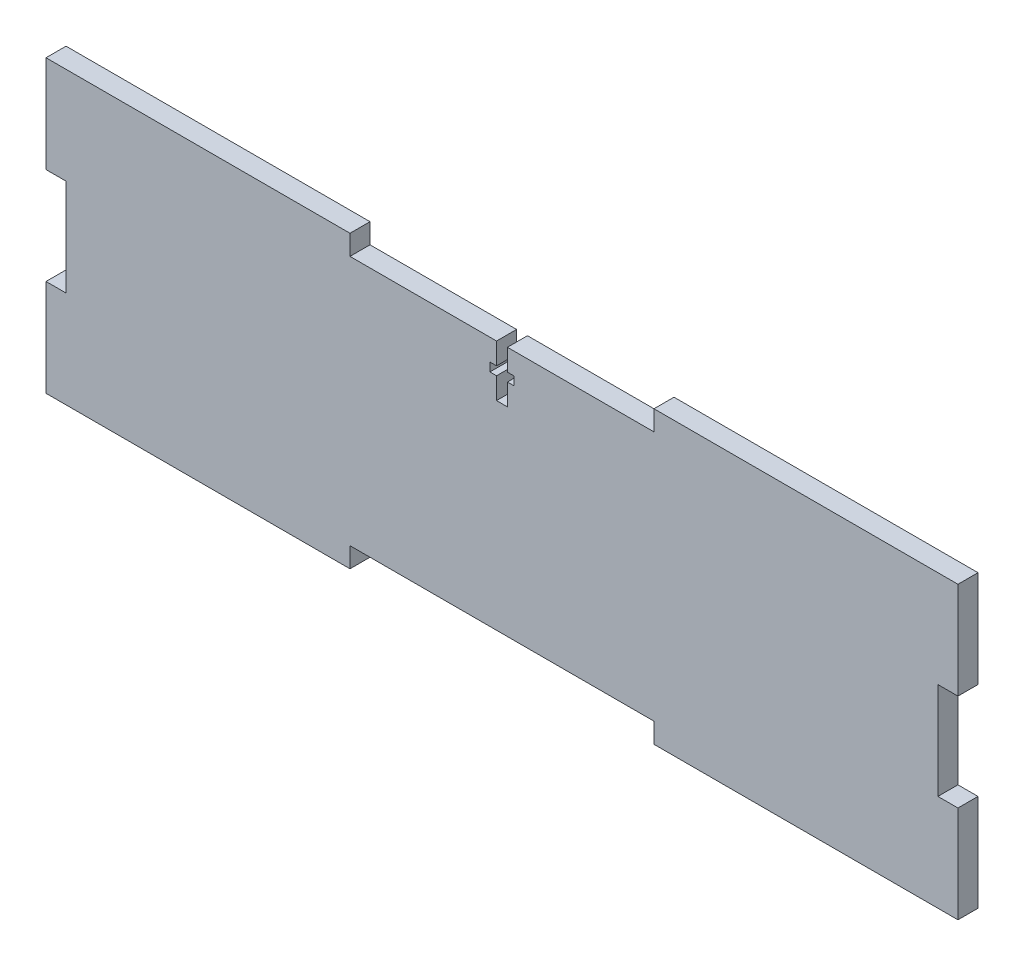
ISO-10303-21;
HEADER;
FILE_DESCRIPTION(('STEP AP214'),'2;1');
FILE_NAME('part.step','',(''),(''),'','','');
FILE_SCHEMA(('AUTOMOTIVE_DESIGN { 1 0 10303 214 1 1 1 1 }'));
ENDSEC;
DATA;
#1=APPLICATION_CONTEXT('core data for automotive mechanical design processes');
#2=APPLICATION_PROTOCOL_DEFINITION('international standard','automotive_design',2000,#1);
#3=PRODUCT_CONTEXT('',#1,'mechanical');
#4=PRODUCT('Part','Part','',(#3));
#5=PRODUCT_RELATED_PRODUCT_CATEGORY('part','',(#4));
#6=PRODUCT_DEFINITION_FORMATION('','',#4);
#7=PRODUCT_DEFINITION_CONTEXT('part definition',#1,'design');
#8=PRODUCT_DEFINITION('design','',#6,#7);
#9=PRODUCT_DEFINITION_SHAPE('','',#8);
#10=(LENGTH_UNIT() NAMED_UNIT(*) SI_UNIT(.MILLI.,.METRE.));
#11=(NAMED_UNIT(*) PLANE_ANGLE_UNIT() SI_UNIT($,.RADIAN.));
#12=(NAMED_UNIT(*) SI_UNIT($,.STERADIAN.) SOLID_ANGLE_UNIT());
#13=UNCERTAINTY_MEASURE_WITH_UNIT(LENGTH_MEASURE(1.E-05),#10,'distance_accuracy_value','');
#14=(GEOMETRIC_REPRESENTATION_CONTEXT(3) GLOBAL_UNCERTAINTY_ASSIGNED_CONTEXT((#13)) GLOBAL_UNIT_ASSIGNED_CONTEXT((#10,
#11,#12)) REPRESENTATION_CONTEXT('',''));
#15=CARTESIAN_POINT('',(0.,0.,0.));
#16=DIRECTION('',(0.,0.,1.));
#17=DIRECTION('',(1.,0.,0.));
#18=AXIS2_PLACEMENT_3D('',#15,#16,#17);
#19=CARTESIAN_POINT('',(1.37795,31.75,0.));
#20=DIRECTION('',(1.,0.,0.));
#21=DIRECTION('',(0.,1.,0.));
#22=AXIS2_PLACEMENT_3D('',#19,#20,#21);
#23=PLANE('',#22);
#24=DIRECTION('',(0.,1.,0.));
#25=VECTOR('',#24,1.);
#26=CARTESIAN_POINT('',(1.37795,31.75,0.));
#27=LINE('',#26,#25);
#28=CARTESIAN_POINT('',(1.37795,26.29535,0.));
#29=VERTEX_POINT('',#28);
#30=CARTESIAN_POINT('',(1.37795,31.75,0.));
#31=VERTEX_POINT('',#30);
#32=EDGE_CURVE('E295',#29,#31,#27,.T.);
#33=ORIENTED_EDGE('',*,*,#32,.F.);
#34=DIRECTION('',(0.,0.,1.));
#35=VECTOR('',#34,1.);
#36=CARTESIAN_POINT('',(1.37795,26.29535,0.));
#37=LINE('',#36,#35);
#38=CARTESIAN_POINT('',(1.37795,26.29535,5.08));
#39=VERTEX_POINT('',#38);
#40=EDGE_CURVE('E287',#29,#39,#37,.T.);
#41=ORIENTED_EDGE('',*,*,#40,.T.);
#42=DIRECTION('',(0.,1.,0.));
#43=VECTOR('',#42,1.);
#44=CARTESIAN_POINT('',(1.37795,31.75,5.08));
#45=LINE('',#44,#43);
#46=CARTESIAN_POINT('',(1.37795,31.75,5.08));
#47=VERTEX_POINT('',#46);
#48=EDGE_CURVE('E290',#39,#47,#45,.T.);
#49=ORIENTED_EDGE('',*,*,#48,.T.);
#50=DIRECTION('',(0.,0.,1.));
#51=VECTOR('',#50,1.);
#52=CARTESIAN_POINT('',(1.37795,31.75,0.));
#53=LINE('',#52,#51);
#54=EDGE_CURVE('E301',#31,#47,#53,.T.);
#55=ORIENTED_EDGE('',*,*,#54,.F.);
#56=EDGE_LOOP('',(#33,#41,#49,#55));
#57=FACE_BOUND('',#56,.T.);
#58=ADVANCED_FACE('F33',(#57),#23,.F.);
#59=CARTESIAN_POINT('',(-1.37795,31.75,0.));
#60=DIRECTION('',(-1.,0.,0.));
#61=DIRECTION('',(0.,-1.,0.));
#62=AXIS2_PLACEMENT_3D('',#59,#60,#61);
#63=PLANE('',#62);
#64=DIRECTION('',(0.,-1.,0.));
#65=VECTOR('',#64,1.);
#66=CARTESIAN_POINT('',(-1.37795,31.75,5.08));
#67=LINE('',#66,#65);
#68=CARTESIAN_POINT('',(-1.37795,31.75,5.08));
#69=VERTEX_POINT('',#68);
#70=CARTESIAN_POINT('',(-1.37795,26.29535,5.08));
#71=VERTEX_POINT('',#70);
#72=EDGE_CURVE('E306',#69,#71,#67,.T.);
#73=ORIENTED_EDGE('',*,*,#72,.T.);
#74=DIRECTION('',(0.,0.,-1.));
#75=VECTOR('',#74,1.);
#76=CARTESIAN_POINT('',(-1.37795,26.29535,0.));
#77=LINE('',#76,#75);
#78=CARTESIAN_POINT('',(-1.37795,26.29535,0.));
#79=VERTEX_POINT('',#78);
#80=EDGE_CURVE('E11',#71,#79,#77,.T.);
#81=ORIENTED_EDGE('',*,*,#80,.T.);
#82=DIRECTION('',(0.,-1.,0.));
#83=VECTOR('',#82,1.);
#84=CARTESIAN_POINT('',(-1.37795,31.75,0.));
#85=LINE('',#84,#83);
#86=CARTESIAN_POINT('',(-1.37795,31.75,0.));
#87=VERTEX_POINT('',#86);
#88=EDGE_CURVE('E296',#87,#79,#85,.T.);
#89=ORIENTED_EDGE('',*,*,#88,.F.);
#90=DIRECTION('',(0.,0.,1.));
#91=VECTOR('',#90,1.);
#92=CARTESIAN_POINT('',(-1.37795,31.75,0.));
#93=LINE('',#92,#91);
#94=EDGE_CURVE('E318',#87,#69,#93,.T.);
#95=ORIENTED_EDGE('',*,*,#94,.T.);
#96=EDGE_LOOP('',(#73,#81,#89,#95));
#97=FACE_BOUND('',#96,.T.);
#98=ADVANCED_FACE('F589',(#97),#63,.F.);
#99=CARTESIAN_POINT('',(-38.5233333333333,31.75,0.));
#100=DIRECTION('',(0.,-1.,0.));
#101=DIRECTION('',(0.,0.,-1.));
#102=AXIS2_PLACEMENT_3D('',#99,#100,#101);
#103=PLANE('',#102);
#104=DIRECTION('',(1.,0.,0.));
#105=VECTOR('',#104,1.);
#106=CARTESIAN_POINT('',(-38.5233333333333,31.75,0.));
#107=LINE('',#106,#105);
#108=CARTESIAN_POINT('',(38.5233333333333,31.75,0.));
#109=VERTEX_POINT('',#108);
#110=EDGE_CURVE('E403',#31,#109,#107,.T.);
#111=ORIENTED_EDGE('',*,*,#110,.F.);
#112=ORIENTED_EDGE('',*,*,#54,.T.);
#113=DIRECTION('',(1.,0.,0.));
#114=VECTOR('',#113,1.);
#115=CARTESIAN_POINT('',(-38.5233333333333,31.75,5.08));
#116=LINE('',#115,#114);
#117=CARTESIAN_POINT('',(38.5233333333333,31.75,5.08));
#118=VERTEX_POINT('',#117);
#119=EDGE_CURVE('E414',#47,#118,#116,.T.);
#120=ORIENTED_EDGE('',*,*,#119,.T.);
#121=DIRECTION('',(0.,0.,1.));
#122=VECTOR('',#121,1.);
#123=CARTESIAN_POINT('',(38.5233333333333,31.75,0.));
#124=LINE('',#123,#122);
#125=EDGE_CURVE('E425',#109,#118,#124,.T.);
#126=ORIENTED_EDGE('',*,*,#125,.F.);
#127=EDGE_LOOP('',(#111,#112,#120,#126));
#128=FACE_BOUND('',#127,.T.);
#129=ADVANCED_FACE('F502',(#128),#103,.F.);
#130=CARTESIAN_POINT('',(115.57,-36.83,5.08));
#131=DIRECTION('',(-1.,0.,0.));
#132=DIRECTION('',(0.,0.,1.));
#133=AXIS2_PLACEMENT_3D('',#130,#131,#132);
#134=PLANE('',#133);
#135=DIRECTION('',(0.,1.,0.));
#136=VECTOR('',#135,1.);
#137=CARTESIAN_POINT('',(115.57,-36.83,0.));
#138=LINE('',#137,#136);
#139=CARTESIAN_POINT('',(115.57,-36.83,0.));
#140=VERTEX_POINT('',#139);
#141=CARTESIAN_POINT('',(115.57,-12.2766666666667,0.));
#142=VERTEX_POINT('',#141);
#143=EDGE_CURVE('E446',#140,#142,#138,.T.);
#144=ORIENTED_EDGE('',*,*,#143,.T.);
#145=DIRECTION('',(0.,0.,1.));
#146=VECTOR('',#145,1.);
#147=CARTESIAN_POINT('',(115.57,-12.2766666666667,0.));
#148=LINE('',#147,#146);
#149=CARTESIAN_POINT('',(115.57,-12.2766666666667,5.08));
#150=VERTEX_POINT('',#149);
#151=EDGE_CURVE('E339',#142,#150,#148,.T.);
#152=ORIENTED_EDGE('',*,*,#151,.T.);
#153=DIRECTION('',(0.,1.,0.));
#154=VECTOR('',#153,1.);
#155=CARTESIAN_POINT('',(115.57,-36.83,5.08));
#156=LINE('',#155,#154);
#157=CARTESIAN_POINT('',(115.57,-36.83,5.08));
#158=VERTEX_POINT('',#157);
#159=EDGE_CURVE('E429',#158,#150,#156,.T.);
#160=ORIENTED_EDGE('',*,*,#159,.F.);
#161=DIRECTION('',(0.,0.,-1.));
#162=VECTOR('',#161,1.);
#163=CARTESIAN_POINT('',(115.57,-36.83,5.08));
#164=LINE('',#163,#162);
#165=EDGE_CURVE('E445',#158,#140,#164,.T.);
#166=ORIENTED_EDGE('',*,*,#165,.T.);
#167=EDGE_LOOP('',(#144,#152,#160,#166));
#168=FACE_BOUND('',#167,.T.);
#169=ADVANCED_FACE('F530',(#168),#134,.F.);
#170=CARTESIAN_POINT('',(-115.57,-36.83,5.08));
#171=DIRECTION('',(1.,0.,0.));
#172=DIRECTION('',(0.,0.,-1.));
#173=AXIS2_PLACEMENT_3D('',#170,#171,#172);
#174=PLANE('',#173);
#175=DIRECTION('',(0.,-1.,0.));
#176=VECTOR('',#175,1.);
#177=CARTESIAN_POINT('',(-115.57,-36.83,0.));
#178=LINE('',#177,#176);
#179=CARTESIAN_POINT('',(-115.57,36.83,0.));
#180=VERTEX_POINT('',#179);
#181=CARTESIAN_POINT('',(-115.57,12.2766666666667,0.));
#182=VERTEX_POINT('',#181);
#183=EDGE_CURVE('E454',#180,#182,#178,.T.);
#184=ORIENTED_EDGE('',*,*,#183,.T.);
#185=DIRECTION('',(0.,0.,1.));
#186=VECTOR('',#185,1.);
#187=CARTESIAN_POINT('',(-115.57,12.2766666666667,0.));
#188=LINE('',#187,#186);
#189=CARTESIAN_POINT('',(-115.57,12.2766666666667,5.08));
#190=VERTEX_POINT('',#189);
#191=EDGE_CURVE('E365',#182,#190,#188,.T.);
#192=ORIENTED_EDGE('',*,*,#191,.T.);
#193=DIRECTION('',(0.,-1.,0.));
#194=VECTOR('',#193,1.);
#195=CARTESIAN_POINT('',(-115.57,-36.83,5.08));
#196=LINE('',#195,#194);
#197=CARTESIAN_POINT('',(-115.57,36.83,5.08));
#198=VERTEX_POINT('',#197);
#199=EDGE_CURVE('E438',#198,#190,#196,.T.);
#200=ORIENTED_EDGE('',*,*,#199,.F.);
#201=DIRECTION('',(0.,0.,-1.));
#202=VECTOR('',#201,1.);
#203=CARTESIAN_POINT('',(-115.57,36.83,5.08));
#204=LINE('',#203,#202);
#205=EDGE_CURVE('E466',#198,#180,#204,.T.);
#206=ORIENTED_EDGE('',*,*,#205,.T.);
#207=EDGE_LOOP('',(#184,#192,#200,#206));
#208=FACE_BOUND('',#207,.T.);
#209=ADVANCED_FACE('F572',(#208),#174,.F.);
#210=CARTESIAN_POINT('',(-115.57,-36.83,5.08));
#211=DIRECTION('',(0.,1.,0.));
#212=DIRECTION('',(0.,0.,1.));
#213=AXIS2_PLACEMENT_3D('',#210,#211,#212);
#214=PLANE('',#213);
#215=DIRECTION('',(1.,0.,0.));
#216=VECTOR('',#215,1.);
#217=CARTESIAN_POINT('',(-115.57,-36.83,0.));
#218=LINE('',#217,#216);
#219=CARTESIAN_POINT('',(-115.57,-36.83,0.));
#220=VERTEX_POINT('',#219);
#221=CARTESIAN_POINT('',(-38.5233333333333,-36.83,0.));
#222=VERTEX_POINT('',#221);
#223=EDGE_CURVE('E458',#220,#222,#218,.T.);
#224=ORIENTED_EDGE('',*,*,#223,.T.);
#225=DIRECTION('',(0.,0.,1.));
#226=VECTOR('',#225,1.);
#227=CARTESIAN_POINT('',(-38.5233333333333,-36.83,0.));
#228=LINE('',#227,#226);
#229=CARTESIAN_POINT('',(-38.5233333333333,-36.83,5.08));
#230=VERTEX_POINT('',#229);
#231=EDGE_CURVE('E391',#222,#230,#228,.T.);
#232=ORIENTED_EDGE('',*,*,#231,.T.);
#233=DIRECTION('',(1.,0.,0.));
#234=VECTOR('',#233,1.);
#235=CARTESIAN_POINT('',(-115.57,-36.83,5.08));
#236=LINE('',#235,#234);
#237=CARTESIAN_POINT('',(-115.57,-36.83,5.08));
#238=VERTEX_POINT('',#237);
#239=EDGE_CURVE('E442',#238,#230,#236,.T.);
#240=ORIENTED_EDGE('',*,*,#239,.F.);
#241=DIRECTION('',(0.,0.,-1.));
#242=VECTOR('',#241,1.);
#243=CARTESIAN_POINT('',(-115.57,-36.83,5.08));
#244=LINE('',#243,#242);
#245=EDGE_CURVE('E463',#238,#220,#244,.T.);
#246=ORIENTED_EDGE('',*,*,#245,.T.);
#247=EDGE_LOOP('',(#224,#232,#240,#246));
#248=FACE_BOUND('',#247,.T.);
#249=ADVANCED_FACE('F551',(#248),#214,.F.);
#250=CARTESIAN_POINT('',(-115.57,36.83,5.08));
#251=DIRECTION('',(0.,-1.,0.));
#252=DIRECTION('',(0.,0.,-1.));
#253=AXIS2_PLACEMENT_3D('',#250,#251,#252);
#254=PLANE('',#253);
#255=DIRECTION('',(-1.,0.,0.));
#256=VECTOR('',#255,1.);
#257=CARTESIAN_POINT('',(-115.57,36.83,5.08));
#258=LINE('',#257,#256);
#259=CARTESIAN_POINT('',(-38.5233333333333,36.83,5.08));
#260=VERTEX_POINT('',#259);
#261=EDGE_CURVE('E432',#260,#198,#258,.T.);
#262=ORIENTED_EDGE('',*,*,#261,.F.);
#263=DIRECTION('',(0.,0.,1.));
#264=VECTOR('',#263,1.);
#265=CARTESIAN_POINT('',(-38.5233333333333,36.83,0.));
#266=LINE('',#265,#264);
#267=CARTESIAN_POINT('',(-38.5233333333333,36.83,0.));
#268=VERTEX_POINT('',#267);
#269=EDGE_CURVE('E419',#268,#260,#266,.T.);
#270=ORIENTED_EDGE('',*,*,#269,.F.);
#271=DIRECTION('',(-1.,0.,0.));
#272=VECTOR('',#271,1.);
#273=CARTESIAN_POINT('',(-115.57,36.83,0.));
#274=LINE('',#273,#272);
#275=EDGE_CURVE('E449',#268,#180,#274,.T.);
#276=ORIENTED_EDGE('',*,*,#275,.T.);
#277=ORIENTED_EDGE('',*,*,#205,.F.);
#278=EDGE_LOOP('',(#262,#270,#276,#277));
#279=FACE_BOUND('',#278,.T.);
#280=ADVANCED_FACE('F577',(#279),#254,.F.);
#281=CARTESIAN_POINT('',(115.57,12.2766666666667,5.08));
#282=VERTEX_POINT('',#281);
#283=CARTESIAN_POINT('',(115.57,36.83,5.08));
#284=VERTEX_POINT('',#283);
#285=EDGE_CURVE('E433',#282,#284,#156,.T.);
#286=ORIENTED_EDGE('',*,*,#285,.F.);
#287=DIRECTION('',(0.,0.,1.));
#288=VECTOR('',#287,1.);
#289=CARTESIAN_POINT('',(115.57,12.2766666666667,0.));
#290=LINE('',#289,#288);
#291=CARTESIAN_POINT('',(115.57,12.2766666666667,0.));
#292=VERTEX_POINT('',#291);
#293=EDGE_CURVE('E332',#292,#282,#290,.T.);
#294=ORIENTED_EDGE('',*,*,#293,.F.);
#295=CARTESIAN_POINT('',(115.57,36.83,0.));
#296=VERTEX_POINT('',#295);
#297=EDGE_CURVE('E421',#292,#296,#138,.T.);
#298=ORIENTED_EDGE('',*,*,#297,.T.);
#299=DIRECTION('',(0.,0.,-1.));
#300=VECTOR('',#299,1.);
#301=CARTESIAN_POINT('',(115.57,36.83,5.08));
#302=LINE('',#301,#300);
#303=EDGE_CURVE('E469',#284,#296,#302,.T.);
#304=ORIENTED_EDGE('',*,*,#303,.F.);
#305=EDGE_LOOP('',(#286,#294,#298,#304));
#306=FACE_BOUND('',#305,.T.);
#307=ADVANCED_FACE('F35',(#306),#134,.F.);
#308=CARTESIAN_POINT('',(38.5233333333333,36.83,0.));
#309=VERTEX_POINT('',#308);
#310=EDGE_CURVE('E450',#296,#309,#274,.T.);
#311=ORIENTED_EDGE('',*,*,#310,.T.);
#312=DIRECTION('',(0.,0.,1.));
#313=VECTOR('',#312,1.);
#314=CARTESIAN_POINT('',(38.5233333333333,36.83,0.));
#315=LINE('',#314,#313);
#316=CARTESIAN_POINT('',(38.5233333333333,36.83,5.08));
#317=VERTEX_POINT('',#316);
#318=EDGE_CURVE('E422',#309,#317,#315,.T.);
#319=ORIENTED_EDGE('',*,*,#318,.T.);
#320=EDGE_CURVE('E434',#284,#317,#258,.T.);
#321=ORIENTED_EDGE('',*,*,#320,.F.);
#322=ORIENTED_EDGE('',*,*,#303,.T.);
#323=EDGE_LOOP('',(#311,#319,#321,#322));
#324=FACE_BOUND('',#323,.T.);
#325=ADVANCED_FACE('F510',(#324),#254,.F.);
#326=CARTESIAN_POINT('',(-115.57,-12.2766666666667,5.08));
#327=VERTEX_POINT('',#326);
#328=EDGE_CURVE('E437',#327,#238,#196,.T.);
#329=ORIENTED_EDGE('',*,*,#328,.F.);
#330=DIRECTION('',(0.,0.,1.));
#331=VECTOR('',#330,1.);
#332=CARTESIAN_POINT('',(-115.57,-12.2766666666667,0.));
#333=LINE('',#332,#331);
#334=CARTESIAN_POINT('',(-115.57,-12.2766666666667,0.));
#335=VERTEX_POINT('',#334);
#336=EDGE_CURVE('E358',#335,#327,#333,.T.);
#337=ORIENTED_EDGE('',*,*,#336,.F.);
#338=EDGE_CURVE('E453',#335,#220,#178,.T.);
#339=ORIENTED_EDGE('',*,*,#338,.T.);
#340=ORIENTED_EDGE('',*,*,#245,.F.);
#341=EDGE_LOOP('',(#329,#337,#339,#340));
#342=FACE_BOUND('',#341,.T.);
#343=ADVANCED_FACE('F556',(#342),#174,.F.);
#344=CARTESIAN_POINT('',(38.5233333333333,-36.83,5.08));
#345=VERTEX_POINT('',#344);
#346=EDGE_CURVE('E441',#345,#158,#236,.T.);
#347=ORIENTED_EDGE('',*,*,#346,.F.);
#348=DIRECTION('',(0.,0.,1.));
#349=VECTOR('',#348,1.);
#350=CARTESIAN_POINT('',(38.5233333333333,-36.83,0.));
#351=LINE('',#350,#349);
#352=CARTESIAN_POINT('',(38.5233333333333,-36.83,0.));
#353=VERTEX_POINT('',#352);
#354=EDGE_CURVE('E384',#353,#345,#351,.T.);
#355=ORIENTED_EDGE('',*,*,#354,.F.);
#356=EDGE_CURVE('E457',#353,#140,#218,.T.);
#357=ORIENTED_EDGE('',*,*,#356,.T.);
#358=ORIENTED_EDGE('',*,*,#165,.F.);
#359=EDGE_LOOP('',(#347,#355,#357,#358));
#360=FACE_BOUND('',#359,.T.);
#361=ADVANCED_FACE('F535',(#360),#214,.F.);
#362=CARTESIAN_POINT('',(0.,0.,5.08));
#363=DIRECTION('',(0.,0.,-1.));
#364=DIRECTION('',(-1.,0.,0.));
#365=AXIS2_PLACEMENT_3D('',#362,#363,#364);
#366=PLANE('',#365);
#367=ORIENTED_EDGE('',*,*,#48,.F.);
#368=DIRECTION('',(-1.,0.,0.));
#369=VECTOR('',#368,1.);
#370=CARTESIAN_POINT('',(-3.048,26.29535,5.08));
#371=LINE('',#370,#369);
#372=CARTESIAN_POINT('',(3.048,26.29535,5.08));
#373=VERTEX_POINT('',#372);
#374=EDGE_CURVE('E265',#373,#39,#371,.T.);
#375=ORIENTED_EDGE('',*,*,#374,.F.);
#376=DIRECTION('',(0.,1.,0.));
#377=VECTOR('',#376,1.);
#378=CARTESIAN_POINT('',(3.048,26.29535,5.08));
#379=LINE('',#378,#377);
#380=CARTESIAN_POINT('',(3.048,24.12365,5.08));
#381=VERTEX_POINT('',#380);
#382=EDGE_CURVE('E276',#381,#373,#379,.T.);
#383=ORIENTED_EDGE('',*,*,#382,.F.);
#384=DIRECTION('',(1.,0.,0.));
#385=VECTOR('',#384,1.);
#386=CARTESIAN_POINT('',(-3.048,24.12365,5.08));
#387=LINE('',#386,#385);
#388=CARTESIAN_POINT('',(1.37795,24.12365,5.08));
#389=VERTEX_POINT('',#388);
#390=EDGE_CURVE('E274',#389,#381,#387,.T.);
#391=ORIENTED_EDGE('',*,*,#390,.F.);
#392=CARTESIAN_POINT('',(1.37795,18.669,5.08));
#393=VERTEX_POINT('',#392);
#394=EDGE_CURVE('E302',#393,#389,#45,.T.);
#395=ORIENTED_EDGE('',*,*,#394,.F.);
#396=DIRECTION('',(1.,0.,0.));
#397=VECTOR('',#396,1.);
#398=CARTESIAN_POINT('',(1.37795,18.669,5.08));
#399=LINE('',#398,#397);
#400=CARTESIAN_POINT('',(-1.37795,18.669,5.08));
#401=VERTEX_POINT('',#400);
#402=EDGE_CURVE('E309',#401,#393,#399,.T.);
#403=ORIENTED_EDGE('',*,*,#402,.F.);
#404=CARTESIAN_POINT('',(-1.37795,24.12365,5.08));
#405=VERTEX_POINT('',#404);
#406=EDGE_CURVE('E305',#405,#401,#67,.T.);
#407=ORIENTED_EDGE('',*,*,#406,.F.);
#408=CARTESIAN_POINT('',(-3.048,24.12365,5.08));
#409=VERTEX_POINT('',#408);
#410=EDGE_CURVE('E56',#409,#405,#387,.T.);
#411=ORIENTED_EDGE('',*,*,#410,.F.);
#412=DIRECTION('',(0.,-1.,0.));
#413=VECTOR('',#412,1.);
#414=CARTESIAN_POINT('',(-3.048,26.29535,5.08));
#415=LINE('',#414,#413);
#416=CARTESIAN_POINT('',(-3.048,26.29535,5.08));
#417=VERTEX_POINT('',#416);
#418=EDGE_CURVE('E250',#417,#409,#415,.T.);
#419=ORIENTED_EDGE('',*,*,#418,.F.);
#420=EDGE_CURVE('E267',#71,#417,#371,.T.);
#421=ORIENTED_EDGE('',*,*,#420,.F.);
#422=ORIENTED_EDGE('',*,*,#72,.F.);
#423=CARTESIAN_POINT('',(-38.5233333333333,31.75,5.08));
#424=VERTEX_POINT('',#423);
#425=EDGE_CURVE('E415',#424,#69,#116,.T.);
#426=ORIENTED_EDGE('',*,*,#425,.F.);
#427=DIRECTION('',(0.,-1.,0.));
#428=VECTOR('',#427,1.);
#429=CARTESIAN_POINT('',(-38.5233333333333,36.83,5.08));
#430=LINE('',#429,#428);
#431=EDGE_CURVE('E394',#260,#424,#430,.T.);
#432=ORIENTED_EDGE('',*,*,#431,.F.);
#433=ORIENTED_EDGE('',*,*,#261,.T.);
#434=ORIENTED_EDGE('',*,*,#199,.T.);
#435=DIRECTION('',(-1.,0.,0.));
#436=VECTOR('',#435,1.);
#437=CARTESIAN_POINT('',(-115.57,12.2766666666667,5.08));
#438=LINE('',#437,#436);
#439=CARTESIAN_POINT('',(-110.49,12.2766666666667,5.08));
#440=VERTEX_POINT('',#439);
#441=EDGE_CURVE('E352',#440,#190,#438,.T.);
#442=ORIENTED_EDGE('',*,*,#441,.F.);
#443=DIRECTION('',(0.,1.,0.));
#444=VECTOR('',#443,1.);
#445=CARTESIAN_POINT('',(-110.49,12.2766666666667,5.08));
#446=LINE('',#445,#444);
#447=CARTESIAN_POINT('',(-110.49,-12.2766666666667,5.08));
#448=VERTEX_POINT('',#447);
#449=EDGE_CURVE('E361',#448,#440,#446,.T.);
#450=ORIENTED_EDGE('',*,*,#449,.F.);
#451=DIRECTION('',(1.,0.,0.));
#452=VECTOR('',#451,1.);
#453=CARTESIAN_POINT('',(-115.57,-12.2766666666667,5.08));
#454=LINE('',#453,#452);
#455=EDGE_CURVE('E342',#327,#448,#454,.T.);
#456=ORIENTED_EDGE('',*,*,#455,.F.);
#457=ORIENTED_EDGE('',*,*,#328,.T.);
#458=ORIENTED_EDGE('',*,*,#239,.T.);
#459=DIRECTION('',(0.,-1.,0.));
#460=VECTOR('',#459,1.);
#461=CARTESIAN_POINT('',(-38.5233333333333,-36.83,5.08));
#462=LINE('',#461,#460);
#463=CARTESIAN_POINT('',(-38.5233333333333,-31.75,5.08));
#464=VERTEX_POINT('',#463);
#465=EDGE_CURVE('E378',#464,#230,#462,.T.);
#466=ORIENTED_EDGE('',*,*,#465,.F.);
#467=DIRECTION('',(-1.,0.,0.));
#468=VECTOR('',#467,1.);
#469=CARTESIAN_POINT('',(-38.5233333333333,-31.75,5.08));
#470=LINE('',#469,#468);
#471=CARTESIAN_POINT('',(38.5233333333333,-31.75,5.08));
#472=VERTEX_POINT('',#471);
#473=EDGE_CURVE('E387',#472,#464,#470,.T.);
#474=ORIENTED_EDGE('',*,*,#473,.F.);
#475=DIRECTION('',(0.,1.,0.));
#476=VECTOR('',#475,1.);
#477=CARTESIAN_POINT('',(38.5233333333333,-36.83,5.08));
#478=LINE('',#477,#476);
#479=EDGE_CURVE('E368',#345,#472,#478,.T.);
#480=ORIENTED_EDGE('',*,*,#479,.F.);
#481=ORIENTED_EDGE('',*,*,#346,.T.);
#482=ORIENTED_EDGE('',*,*,#159,.T.);
#483=DIRECTION('',(1.,0.,0.));
#484=VECTOR('',#483,1.);
#485=CARTESIAN_POINT('',(115.57,-12.2766666666667,5.08));
#486=LINE('',#485,#484);
#487=CARTESIAN_POINT('',(110.49,-12.2766666666667,5.08));
#488=VERTEX_POINT('',#487);
#489=EDGE_CURVE('E326',#488,#150,#486,.T.);
#490=ORIENTED_EDGE('',*,*,#489,.F.);
#491=DIRECTION('',(0.,-1.,0.));
#492=VECTOR('',#491,1.);
#493=CARTESIAN_POINT('',(110.49,12.2766666666667,5.08));
#494=LINE('',#493,#492);
#495=CARTESIAN_POINT('',(110.49,12.2766666666667,5.08));
#496=VERTEX_POINT('',#495);
#497=EDGE_CURVE('E335',#496,#488,#494,.T.);
#498=ORIENTED_EDGE('',*,*,#497,.F.);
#499=DIRECTION('',(-1.,0.,0.));
#500=VECTOR('',#499,1.);
#501=CARTESIAN_POINT('',(115.57,12.2766666666667,5.08));
#502=LINE('',#501,#500);
#503=EDGE_CURVE('E314',#282,#496,#502,.T.);
#504=ORIENTED_EDGE('',*,*,#503,.F.);
#505=ORIENTED_EDGE('',*,*,#285,.T.);
#506=ORIENTED_EDGE('',*,*,#320,.T.);
#507=DIRECTION('',(0.,1.,0.));
#508=VECTOR('',#507,1.);
#509=CARTESIAN_POINT('',(38.5233333333333,36.83,5.08));
#510=LINE('',#509,#508);
#511=EDGE_CURVE('E404',#118,#317,#510,.T.);
#512=ORIENTED_EDGE('',*,*,#511,.F.);
#513=ORIENTED_EDGE('',*,*,#119,.F.);
#514=EDGE_LOOP('',(#367,#375,#383,#391,#395,#403,#407,#411,#419,#421,#422,#426,#432,#433,#434,
#442,#450,#456,#457,#458,#466,#474,#480,#481,#482,#490,#498,#504,#505,#506,#512,#513));
#515=FACE_BOUND('',#514,.T.);
#516=ADVANCED_FACE('F478',(#515),#366,.F.);
#517=CARTESIAN_POINT('',(0.,0.,0.));
#518=DIRECTION('',(0.,0.,-1.));
#519=DIRECTION('',(-1.,0.,0.));
#520=AXIS2_PLACEMENT_3D('',#517,#518,#519);
#521=PLANE('',#520);
#522=DIRECTION('',(-1.,0.,0.));
#523=VECTOR('',#522,1.);
#524=CARTESIAN_POINT('',(-3.048,26.29535,0.));
#525=LINE('',#524,#523);
#526=CARTESIAN_POINT('',(3.048,26.29535,0.));
#527=VERTEX_POINT('',#526);
#528=EDGE_CURVE('E252',#527,#29,#525,.T.);
#529=ORIENTED_EDGE('',*,*,#528,.T.);
#530=ORIENTED_EDGE('',*,*,#32,.T.);
#531=ORIENTED_EDGE('',*,*,#110,.T.);
#532=DIRECTION('',(0.,1.,0.));
#533=VECTOR('',#532,1.);
#534=CARTESIAN_POINT('',(38.5233333333333,36.83,0.));
#535=LINE('',#534,#533);
#536=EDGE_CURVE('E408',#109,#309,#535,.T.);
#537=ORIENTED_EDGE('',*,*,#536,.T.);
#538=ORIENTED_EDGE('',*,*,#310,.F.);
#539=ORIENTED_EDGE('',*,*,#297,.F.);
#540=DIRECTION('',(-1.,0.,0.));
#541=VECTOR('',#540,1.);
#542=CARTESIAN_POINT('',(115.57,12.2766666666667,0.));
#543=LINE('',#542,#541);
#544=CARTESIAN_POINT('',(110.49,12.2766666666667,0.));
#545=VERTEX_POINT('',#544);
#546=EDGE_CURVE('E322',#292,#545,#543,.T.);
#547=ORIENTED_EDGE('',*,*,#546,.T.);
#548=DIRECTION('',(0.,-1.,0.));
#549=VECTOR('',#548,1.);
#550=CARTESIAN_POINT('',(110.49,12.2766666666667,0.));
#551=LINE('',#550,#549);
#552=CARTESIAN_POINT('',(110.49,-12.2766666666667,0.));
#553=VERTEX_POINT('',#552);
#554=EDGE_CURVE('E325',#545,#553,#551,.T.);
#555=ORIENTED_EDGE('',*,*,#554,.T.);
#556=DIRECTION('',(1.,0.,0.));
#557=VECTOR('',#556,1.);
#558=CARTESIAN_POINT('',(115.57,-12.2766666666667,0.));
#559=LINE('',#558,#557);
#560=EDGE_CURVE('E329',#553,#142,#559,.T.);
#561=ORIENTED_EDGE('',*,*,#560,.T.);
#562=ORIENTED_EDGE('',*,*,#143,.F.);
#563=ORIENTED_EDGE('',*,*,#356,.F.);
#564=DIRECTION('',(0.,1.,0.));
#565=VECTOR('',#564,1.);
#566=CARTESIAN_POINT('',(38.5233333333333,-36.83,0.));
#567=LINE('',#566,#565);
#568=CARTESIAN_POINT('',(38.5233333333333,-31.75,0.));
#569=VERTEX_POINT('',#568);
#570=EDGE_CURVE('E374',#353,#569,#567,.T.);
#571=ORIENTED_EDGE('',*,*,#570,.T.);
#572=DIRECTION('',(-1.,0.,0.));
#573=VECTOR('',#572,1.);
#574=CARTESIAN_POINT('',(-38.5233333333333,-31.75,0.));
#575=LINE('',#574,#573);
#576=CARTESIAN_POINT('',(-38.5233333333333,-31.75,0.));
#577=VERTEX_POINT('',#576);
#578=EDGE_CURVE('E377',#569,#577,#575,.T.);
#579=ORIENTED_EDGE('',*,*,#578,.T.);
#580=DIRECTION('',(0.,-1.,0.));
#581=VECTOR('',#580,1.);
#582=CARTESIAN_POINT('',(-38.5233333333333,-36.83,0.));
#583=LINE('',#582,#581);
#584=EDGE_CURVE('E381',#577,#222,#583,.T.);
#585=ORIENTED_EDGE('',*,*,#584,.T.);
#586=ORIENTED_EDGE('',*,*,#223,.F.);
#587=ORIENTED_EDGE('',*,*,#338,.F.);
#588=DIRECTION('',(1.,0.,0.));
#589=VECTOR('',#588,1.);
#590=CARTESIAN_POINT('',(-115.57,-12.2766666666667,0.));
#591=LINE('',#590,#589);
#592=CARTESIAN_POINT('',(-110.49,-12.2766666666667,0.));
#593=VERTEX_POINT('',#592);
#594=EDGE_CURVE('E348',#335,#593,#591,.T.);
#595=ORIENTED_EDGE('',*,*,#594,.T.);
#596=DIRECTION('',(0.,1.,0.));
#597=VECTOR('',#596,1.);
#598=CARTESIAN_POINT('',(-110.49,12.2766666666667,0.));
#599=LINE('',#598,#597);
#600=CARTESIAN_POINT('',(-110.49,12.2766666666667,0.));
#601=VERTEX_POINT('',#600);
#602=EDGE_CURVE('E351',#593,#601,#599,.T.);
#603=ORIENTED_EDGE('',*,*,#602,.T.);
#604=DIRECTION('',(-1.,0.,0.));
#605=VECTOR('',#604,1.);
#606=CARTESIAN_POINT('',(-115.57,12.2766666666667,0.));
#607=LINE('',#606,#605);
#608=EDGE_CURVE('E355',#601,#182,#607,.T.);
#609=ORIENTED_EDGE('',*,*,#608,.T.);
#610=ORIENTED_EDGE('',*,*,#183,.F.);
#611=ORIENTED_EDGE('',*,*,#275,.F.);
#612=DIRECTION('',(0.,-1.,0.));
#613=VECTOR('',#612,1.);
#614=CARTESIAN_POINT('',(-38.5233333333333,36.83,0.));
#615=LINE('',#614,#613);
#616=CARTESIAN_POINT('',(-38.5233333333333,31.75,0.));
#617=VERTEX_POINT('',#616);
#618=EDGE_CURVE('E400',#268,#617,#615,.T.);
#619=ORIENTED_EDGE('',*,*,#618,.T.);
#620=EDGE_CURVE('E405',#617,#87,#107,.T.);
#621=ORIENTED_EDGE('',*,*,#620,.T.);
#622=ORIENTED_EDGE('',*,*,#88,.T.);
#623=CARTESIAN_POINT('',(-3.048,26.29535,0.));
#624=VERTEX_POINT('',#623);
#625=EDGE_CURVE('E264',#79,#624,#525,.T.);
#626=ORIENTED_EDGE('',*,*,#625,.T.);
#627=DIRECTION('',(0.,-1.,0.));
#628=VECTOR('',#627,1.);
#629=CARTESIAN_POINT('',(-3.048,26.29535,0.));
#630=LINE('',#629,#628);
#631=CARTESIAN_POINT('',(-3.048,24.12365,0.));
#632=VERTEX_POINT('',#631);
#633=EDGE_CURVE('E247',#624,#632,#630,.T.);
#634=ORIENTED_EDGE('',*,*,#633,.T.);
#635=DIRECTION('',(1.,0.,0.));
#636=VECTOR('',#635,1.);
#637=CARTESIAN_POINT('',(-3.048,24.12365,0.));
#638=LINE('',#637,#636);
#639=CARTESIAN_POINT('',(-1.37795,24.12365,0.));
#640=VERTEX_POINT('',#639);
#641=EDGE_CURVE('E255',#632,#640,#638,.T.);
#642=ORIENTED_EDGE('',*,*,#641,.T.);
#643=CARTESIAN_POINT('',(-1.37795,18.669,0.));
#644=VERTEX_POINT('',#643);
#645=EDGE_CURVE('E294',#640,#644,#85,.T.);
#646=ORIENTED_EDGE('',*,*,#645,.T.);
#647=DIRECTION('',(1.,0.,0.));
#648=VECTOR('',#647,1.);
#649=CARTESIAN_POINT('',(1.37795,18.669,0.));
#650=LINE('',#649,#648);
#651=CARTESIAN_POINT('',(1.37795,18.669,0.));
#652=VERTEX_POINT('',#651);
#653=EDGE_CURVE('E298',#644,#652,#650,.T.);
#654=ORIENTED_EDGE('',*,*,#653,.T.);
#655=CARTESIAN_POINT('',(1.37795,24.12365,0.));
#656=VERTEX_POINT('',#655);
#657=EDGE_CURVE('E291',#652,#656,#27,.T.);
#658=ORIENTED_EDGE('',*,*,#657,.T.);
#659=CARTESIAN_POINT('',(3.048,24.12365,0.));
#660=VERTEX_POINT('',#659);
#661=EDGE_CURVE('E48',#656,#660,#638,.T.);
#662=ORIENTED_EDGE('',*,*,#661,.T.);
#663=DIRECTION('',(0.,1.,0.));
#664=VECTOR('',#663,1.);
#665=CARTESIAN_POINT('',(3.048,26.29535,0.));
#666=LINE('',#665,#664);
#667=EDGE_CURVE('E259',#660,#527,#666,.T.);
#668=ORIENTED_EDGE('',*,*,#667,.T.);
#669=EDGE_LOOP('',(#529,#530,#531,#537,#538,#539,#547,#555,#561,#562,#563,#571,#579,#585,#586,
#587,#595,#603,#609,#610,#611,#619,#621,#622,#626,#634,#642,#646,#654,#658,#662,#668));
#670=FACE_BOUND('',#669,.T.);
#671=ADVANCED_FACE('F262',(#670),#521,.T.);
#672=CARTESIAN_POINT('',(-38.5233333333333,36.83,0.));
#673=DIRECTION('',(-1.,0.,0.));
#674=DIRECTION('',(0.,0.,1.));
#675=AXIS2_PLACEMENT_3D('',#672,#673,#674);
#676=PLANE('',#675);
#677=ORIENTED_EDGE('',*,*,#431,.T.);
#678=DIRECTION('',(0.,0.,1.));
#679=VECTOR('',#678,1.);
#680=CARTESIAN_POINT('',(-38.5233333333333,31.75,0.));
#681=LINE('',#680,#679);
#682=EDGE_CURVE('E411',#617,#424,#681,.T.);
#683=ORIENTED_EDGE('',*,*,#682,.F.);
#684=ORIENTED_EDGE('',*,*,#618,.F.);
#685=ORIENTED_EDGE('',*,*,#269,.T.);
#686=EDGE_LOOP('',(#677,#683,#684,#685));
#687=FACE_BOUND('',#686,.T.);
#688=ADVANCED_FACE('F581',(#687),#676,.F.);
#689=CARTESIAN_POINT('',(38.5233333333333,36.83,0.));
#690=DIRECTION('',(1.,0.,0.));
#691=DIRECTION('',(0.,0.,-1.));
#692=AXIS2_PLACEMENT_3D('',#689,#690,#691);
#693=PLANE('',#692);
#694=ORIENTED_EDGE('',*,*,#511,.T.);
#695=ORIENTED_EDGE('',*,*,#318,.F.);
#696=ORIENTED_EDGE('',*,*,#536,.F.);
#697=ORIENTED_EDGE('',*,*,#125,.T.);
#698=EDGE_LOOP('',(#694,#695,#696,#697));
#699=FACE_BOUND('',#698,.T.);
#700=ADVANCED_FACE('F506',(#699),#693,.F.);
#701=ORIENTED_EDGE('',*,*,#425,.T.);
#702=ORIENTED_EDGE('',*,*,#94,.F.);
#703=ORIENTED_EDGE('',*,*,#620,.F.);
#704=ORIENTED_EDGE('',*,*,#682,.T.);
#705=EDGE_LOOP('',(#701,#702,#703,#704));
#706=FACE_BOUND('',#705,.T.);
#707=ADVANCED_FACE('F586',(#706),#103,.F.);
#708=CARTESIAN_POINT('',(-38.5233333333333,-36.83,0.));
#709=DIRECTION('',(-1.,0.,0.));
#710=DIRECTION('',(0.,0.,1.));
#711=AXIS2_PLACEMENT_3D('',#708,#709,#710);
#712=PLANE('',#711);
#713=ORIENTED_EDGE('',*,*,#465,.T.);
#714=ORIENTED_EDGE('',*,*,#231,.F.);
#715=ORIENTED_EDGE('',*,*,#584,.F.);
#716=DIRECTION('',(0.,0.,1.));
#717=VECTOR('',#716,1.);
#718=CARTESIAN_POINT('',(-38.5233333333333,-31.75,0.));
#719=LINE('',#718,#717);
#720=EDGE_CURVE('E395',#577,#464,#719,.T.);
#721=ORIENTED_EDGE('',*,*,#720,.T.);
#722=EDGE_LOOP('',(#713,#714,#715,#721));
#723=FACE_BOUND('',#722,.T.);
#724=ADVANCED_FACE('F547',(#723),#712,.F.);
#725=CARTESIAN_POINT('',(-38.5233333333333,-31.75,0.));
#726=DIRECTION('',(0.,1.,0.));
#727=DIRECTION('',(0.,0.,1.));
#728=AXIS2_PLACEMENT_3D('',#725,#726,#727);
#729=PLANE('',#728);
#730=ORIENTED_EDGE('',*,*,#473,.T.);
#731=ORIENTED_EDGE('',*,*,#720,.F.);
#732=ORIENTED_EDGE('',*,*,#578,.F.);
#733=DIRECTION('',(0.,0.,1.));
#734=VECTOR('',#733,1.);
#735=CARTESIAN_POINT('',(38.5233333333333,-31.75,0.));
#736=LINE('',#735,#734);
#737=EDGE_CURVE('E397',#569,#472,#736,.T.);
#738=ORIENTED_EDGE('',*,*,#737,.T.);
#739=EDGE_LOOP('',(#730,#731,#732,#738));
#740=FACE_BOUND('',#739,.T.);
#741=ADVANCED_FACE('F543',(#740),#729,.F.);
#742=CARTESIAN_POINT('',(38.5233333333333,-36.83,0.));
#743=DIRECTION('',(1.,0.,0.));
#744=DIRECTION('',(0.,0.,-1.));
#745=AXIS2_PLACEMENT_3D('',#742,#743,#744);
#746=PLANE('',#745);
#747=ORIENTED_EDGE('',*,*,#479,.T.);
#748=ORIENTED_EDGE('',*,*,#737,.F.);
#749=ORIENTED_EDGE('',*,*,#570,.F.);
#750=ORIENTED_EDGE('',*,*,#354,.T.);
#751=EDGE_LOOP('',(#747,#748,#749,#750));
#752=FACE_BOUND('',#751,.T.);
#753=ADVANCED_FACE('F539',(#752),#746,.F.);
#754=CARTESIAN_POINT('',(-115.57,12.2766666666667,0.));
#755=DIRECTION('',(0.,1.,0.));
#756=DIRECTION('',(0.,0.,1.));
#757=AXIS2_PLACEMENT_3D('',#754,#755,#756);
#758=PLANE('',#757);
#759=ORIENTED_EDGE('',*,*,#441,.T.);
#760=ORIENTED_EDGE('',*,*,#191,.F.);
#761=ORIENTED_EDGE('',*,*,#608,.F.);
#762=DIRECTION('',(0.,0.,1.));
#763=VECTOR('',#762,1.);
#764=CARTESIAN_POINT('',(-110.49,12.2766666666667,0.));
#765=LINE('',#764,#763);
#766=EDGE_CURVE('E369',#601,#440,#765,.T.);
#767=ORIENTED_EDGE('',*,*,#766,.T.);
#768=EDGE_LOOP('',(#759,#760,#761,#767));
#769=FACE_BOUND('',#768,.T.);
#770=ADVANCED_FACE('F568',(#769),#758,.F.);
#771=CARTESIAN_POINT('',(-110.49,12.2766666666667,0.));
#772=DIRECTION('',(1.,0.,0.));
#773=DIRECTION('',(0.,0.,-1.));
#774=AXIS2_PLACEMENT_3D('',#771,#772,#773);
#775=PLANE('',#774);
#776=ORIENTED_EDGE('',*,*,#449,.T.);
#777=ORIENTED_EDGE('',*,*,#766,.F.);
#778=ORIENTED_EDGE('',*,*,#602,.F.);
#779=DIRECTION('',(0.,0.,1.));
#780=VECTOR('',#779,1.);
#781=CARTESIAN_POINT('',(-110.49,-12.2766666666667,0.));
#782=LINE('',#781,#780);
#783=EDGE_CURVE('E371',#593,#448,#782,.T.);
#784=ORIENTED_EDGE('',*,*,#783,.T.);
#785=EDGE_LOOP('',(#776,#777,#778,#784));
#786=FACE_BOUND('',#785,.T.);
#787=ADVANCED_FACE('F564',(#786),#775,.F.);
#788=CARTESIAN_POINT('',(-115.57,-12.2766666666667,0.));
#789=DIRECTION('',(0.,-1.,0.));
#790=DIRECTION('',(0.,0.,-1.));
#791=AXIS2_PLACEMENT_3D('',#788,#789,#790);
#792=PLANE('',#791);
#793=ORIENTED_EDGE('',*,*,#455,.T.);
#794=ORIENTED_EDGE('',*,*,#783,.F.);
#795=ORIENTED_EDGE('',*,*,#594,.F.);
#796=ORIENTED_EDGE('',*,*,#336,.T.);
#797=EDGE_LOOP('',(#793,#794,#795,#796));
#798=FACE_BOUND('',#797,.T.);
#799=ADVANCED_FACE('F560',(#798),#792,.F.);
#800=CARTESIAN_POINT('',(115.57,-12.2766666666667,0.));
#801=DIRECTION('',(0.,-1.,0.));
#802=DIRECTION('',(0.,0.,-1.));
#803=AXIS2_PLACEMENT_3D('',#800,#801,#802);
#804=PLANE('',#803);
#805=ORIENTED_EDGE('',*,*,#489,.T.);
#806=ORIENTED_EDGE('',*,*,#151,.F.);
#807=ORIENTED_EDGE('',*,*,#560,.F.);
#808=DIRECTION('',(0.,0.,1.));
#809=VECTOR('',#808,1.);
#810=CARTESIAN_POINT('',(110.49,-12.2766666666667,0.));
#811=LINE('',#810,#809);
#812=EDGE_CURVE('E343',#553,#488,#811,.T.);
#813=ORIENTED_EDGE('',*,*,#812,.T.);
#814=EDGE_LOOP('',(#805,#806,#807,#813));
#815=FACE_BOUND('',#814,.T.);
#816=ADVANCED_FACE('F526',(#815),#804,.F.);
#817=CARTESIAN_POINT('',(110.49,12.2766666666667,0.));
#818=DIRECTION('',(-1.,0.,0.));
#819=DIRECTION('',(0.,0.,1.));
#820=AXIS2_PLACEMENT_3D('',#817,#818,#819);
#821=PLANE('',#820);
#822=ORIENTED_EDGE('',*,*,#497,.T.);
#823=ORIENTED_EDGE('',*,*,#812,.F.);
#824=ORIENTED_EDGE('',*,*,#554,.F.);
#825=DIRECTION('',(0.,0.,1.));
#826=VECTOR('',#825,1.);
#827=CARTESIAN_POINT('',(110.49,12.2766666666667,0.));
#828=LINE('',#827,#826);
#829=EDGE_CURVE('E345',#545,#496,#828,.T.);
#830=ORIENTED_EDGE('',*,*,#829,.T.);
#831=EDGE_LOOP('',(#822,#823,#824,#830));
#832=FACE_BOUND('',#831,.T.);
#833=ADVANCED_FACE('F522',(#832),#821,.F.);
#834=CARTESIAN_POINT('',(115.57,12.2766666666667,0.));
#835=DIRECTION('',(0.,1.,0.));
#836=DIRECTION('',(0.,0.,1.));
#837=AXIS2_PLACEMENT_3D('',#834,#835,#836);
#838=PLANE('',#837);
#839=ORIENTED_EDGE('',*,*,#503,.T.);
#840=ORIENTED_EDGE('',*,*,#829,.F.);
#841=ORIENTED_EDGE('',*,*,#546,.F.);
#842=ORIENTED_EDGE('',*,*,#293,.T.);
#843=EDGE_LOOP('',(#839,#840,#841,#842));
#844=FACE_BOUND('',#843,.T.);
#845=ADVANCED_FACE('F520',(#844),#838,.F.);
#846=ORIENTED_EDGE('',*,*,#394,.T.);
#847=DIRECTION('',(0.,0.,-1.));
#848=VECTOR('',#847,1.);
#849=CARTESIAN_POINT('',(1.37795,24.12365,0.));
#850=LINE('',#849,#848);
#851=EDGE_CURVE('E281',#389,#656,#850,.T.);
#852=ORIENTED_EDGE('',*,*,#851,.T.);
#853=ORIENTED_EDGE('',*,*,#657,.F.);
#854=DIRECTION('',(0.,0.,1.));
#855=VECTOR('',#854,1.);
#856=CARTESIAN_POINT('',(1.37795,18.669,0.));
#857=LINE('',#856,#855);
#858=EDGE_CURVE('E312',#652,#393,#857,.T.);
#859=ORIENTED_EDGE('',*,*,#858,.T.);
#860=EDGE_LOOP('',(#846,#852,#853,#859));
#861=FACE_BOUND('',#860,.T.);
#862=ADVANCED_FACE('F486',(#861),#23,.F.);
#863=CARTESIAN_POINT('',(1.37795,18.669,0.));
#864=DIRECTION('',(0.,-1.,0.));
#865=DIRECTION('',(0.,0.,-1.));
#866=AXIS2_PLACEMENT_3D('',#863,#864,#865);
#867=PLANE('',#866);
#868=ORIENTED_EDGE('',*,*,#402,.T.);
#869=ORIENTED_EDGE('',*,*,#858,.F.);
#870=ORIENTED_EDGE('',*,*,#653,.F.);
#871=DIRECTION('',(0.,0.,1.));
#872=VECTOR('',#871,1.);
#873=CARTESIAN_POINT('',(-1.37795,18.669,0.));
#874=LINE('',#873,#872);
#875=EDGE_CURVE('E315',#644,#401,#874,.T.);
#876=ORIENTED_EDGE('',*,*,#875,.T.);
#877=EDGE_LOOP('',(#868,#869,#870,#876));
#878=FACE_BOUND('',#877,.T.);
#879=ADVANCED_FACE('F482',(#878),#867,.F.);
#880=ORIENTED_EDGE('',*,*,#645,.F.);
#881=DIRECTION('',(0.,0.,1.));
#882=VECTOR('',#881,1.);
#883=CARTESIAN_POINT('',(-1.37795,24.12365,0.));
#884=LINE('',#883,#882);
#885=EDGE_CURVE('E41',#640,#405,#884,.T.);
#886=ORIENTED_EDGE('',*,*,#885,.T.);
#887=ORIENTED_EDGE('',*,*,#406,.T.);
#888=ORIENTED_EDGE('',*,*,#875,.F.);
#889=EDGE_LOOP('',(#880,#886,#887,#888));
#890=FACE_BOUND('',#889,.T.);
#891=ADVANCED_FACE('F473',(#890),#63,.F.);
#892=CARTESIAN_POINT('',(-3.048,24.12365,0.));
#893=DIRECTION('',(0.,-1.,0.));
#894=DIRECTION('',(0.,0.,-1.));
#895=AXIS2_PLACEMENT_3D('',#892,#893,#894);
#896=PLANE('',#895);
#897=ORIENTED_EDGE('',*,*,#641,.F.);
#898=DIRECTION('',(0.,0.,1.));
#899=VECTOR('',#898,1.);
#900=CARTESIAN_POINT('',(-3.048,24.12365,0.));
#901=LINE('',#900,#899);
#902=EDGE_CURVE('E242',#632,#409,#901,.T.);
#903=ORIENTED_EDGE('',*,*,#902,.T.);
#904=ORIENTED_EDGE('',*,*,#410,.T.);
#905=ORIENTED_EDGE('',*,*,#885,.F.);
#906=EDGE_LOOP('',(#897,#903,#904,#905));
#907=FACE_BOUND('',#906,.T.);
#908=ADVANCED_FACE('F256',(#907),#896,.F.);
#909=CARTESIAN_POINT('',(-3.048,26.29535,0.));
#910=DIRECTION('',(0.,1.,0.));
#911=DIRECTION('',(0.,0.,1.));
#912=AXIS2_PLACEMENT_3D('',#909,#910,#911);
#913=PLANE('',#912);
#914=ORIENTED_EDGE('',*,*,#420,.T.);
#915=DIRECTION('',(0.,0.,1.));
#916=VECTOR('',#915,1.);
#917=CARTESIAN_POINT('',(-3.048,26.29535,0.));
#918=LINE('',#917,#916);
#919=EDGE_CURVE('E279',#624,#417,#918,.T.);
#920=ORIENTED_EDGE('',*,*,#919,.F.);
#921=ORIENTED_EDGE('',*,*,#625,.F.);
#922=ORIENTED_EDGE('',*,*,#80,.F.);
#923=EDGE_LOOP('',(#914,#920,#921,#922));
#924=FACE_BOUND('',#923,.T.);
#925=ADVANCED_FACE('F592',(#924),#913,.F.);
#926=CARTESIAN_POINT('',(-3.048,26.29535,0.));
#927=DIRECTION('',(-1.,0.,0.));
#928=DIRECTION('',(0.,0.,1.));
#929=AXIS2_PLACEMENT_3D('',#926,#927,#928);
#930=PLANE('',#929);
#931=ORIENTED_EDGE('',*,*,#418,.T.);
#932=ORIENTED_EDGE('',*,*,#902,.F.);
#933=ORIENTED_EDGE('',*,*,#633,.F.);
#934=ORIENTED_EDGE('',*,*,#919,.T.);
#935=EDGE_LOOP('',(#931,#932,#933,#934));
#936=FACE_BOUND('',#935,.T.);
#937=ADVANCED_FACE('F244',(#936),#930,.F.);
#938=ORIENTED_EDGE('',*,*,#528,.F.);
#939=DIRECTION('',(0.,0.,1.));
#940=VECTOR('',#939,1.);
#941=CARTESIAN_POINT('',(3.048,26.29535,0.));
#942=LINE('',#941,#940);
#943=EDGE_CURVE('E282',#527,#373,#942,.T.);
#944=ORIENTED_EDGE('',*,*,#943,.T.);
#945=ORIENTED_EDGE('',*,*,#374,.T.);
#946=ORIENTED_EDGE('',*,*,#40,.F.);
#947=EDGE_LOOP('',(#938,#944,#945,#946));
#948=FACE_BOUND('',#947,.T.);
#949=ADVANCED_FACE('F595',(#948),#913,.F.);
#950=ORIENTED_EDGE('',*,*,#390,.T.);
#951=DIRECTION('',(0.,0.,1.));
#952=VECTOR('',#951,1.);
#953=CARTESIAN_POINT('',(3.048,24.12365,0.));
#954=LINE('',#953,#952);
#955=EDGE_CURVE('E251',#660,#381,#954,.T.);
#956=ORIENTED_EDGE('',*,*,#955,.F.);
#957=ORIENTED_EDGE('',*,*,#661,.F.);
#958=ORIENTED_EDGE('',*,*,#851,.F.);
#959=EDGE_LOOP('',(#950,#956,#957,#958));
#960=FACE_BOUND('',#959,.T.);
#961=ADVANCED_FACE('F487',(#960),#896,.F.);
#962=CARTESIAN_POINT('',(3.048,26.29535,0.));
#963=DIRECTION('',(1.,0.,0.));
#964=DIRECTION('',(0.,0.,-1.));
#965=AXIS2_PLACEMENT_3D('',#962,#963,#964);
#966=PLANE('',#965);
#967=ORIENTED_EDGE('',*,*,#382,.T.);
#968=ORIENTED_EDGE('',*,*,#943,.F.);
#969=ORIENTED_EDGE('',*,*,#667,.F.);
#970=ORIENTED_EDGE('',*,*,#955,.T.);
#971=EDGE_LOOP('',(#967,#968,#969,#970));
#972=FACE_BOUND('',#971,.T.);
#973=ADVANCED_FACE('F491',(#972),#966,.F.);
#974=CLOSED_SHELL('',(#58,#98,#129,#169,#209,#249,#280,#307,#325,#343,#361,#516,#671,#688,#700,
#707,#724,#741,#753,#770,#787,#799,#816,#833,#845,#862,#879,#891,#908,#925,#937,#949,#961,#973));
#975=MANIFOLD_SOLID_BREP('B2',#974);
#976=ADVANCED_BREP_SHAPE_REPRESENTATION('',(#18,#975),#14);
#977=SHAPE_DEFINITION_REPRESENTATION(#9,#976);
ENDSEC;
END-ISO-10303-21;
